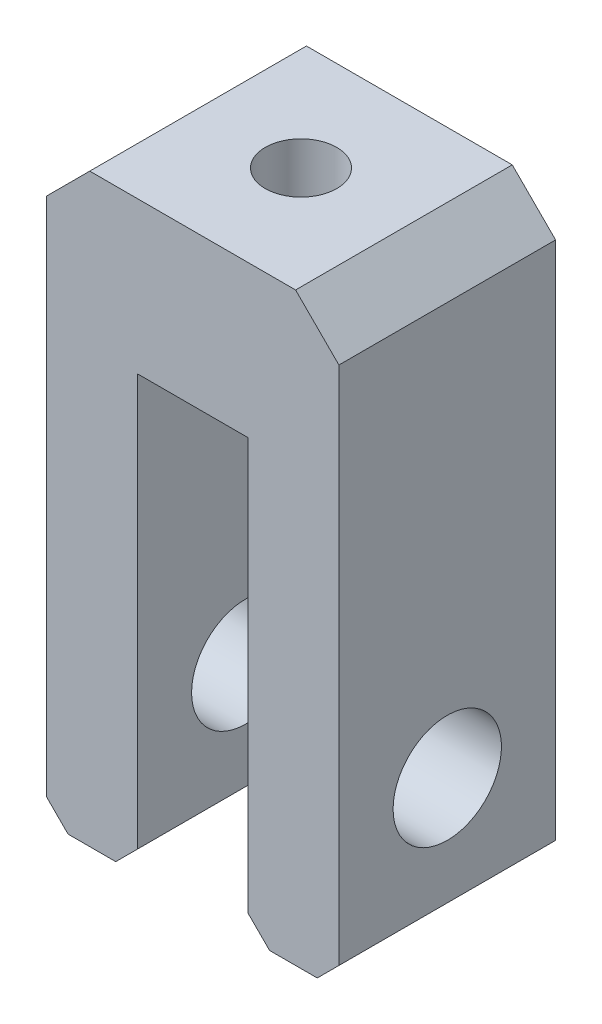
ISO-10303-21;
HEADER;
FILE_DESCRIPTION(('STEP AP214'),'2;1');
FILE_NAME('part.step','',(''),(''),'','','');
FILE_SCHEMA(('AUTOMOTIVE_DESIGN { 1 0 10303 214 1 1 1 1 }'));
ENDSEC;
DATA;
#1=APPLICATION_CONTEXT('core data for automotive mechanical design processes');
#2=APPLICATION_PROTOCOL_DEFINITION('international standard','automotive_design',2000,#1);
#3=PRODUCT_CONTEXT('',#1,'mechanical');
#4=PRODUCT('Part','Part','',(#3));
#5=PRODUCT_RELATED_PRODUCT_CATEGORY('part','',(#4));
#6=PRODUCT_DEFINITION_FORMATION('','',#4);
#7=PRODUCT_DEFINITION_CONTEXT('part definition',#1,'design');
#8=PRODUCT_DEFINITION('design','',#6,#7);
#9=PRODUCT_DEFINITION_SHAPE('','',#8);
#10=(LENGTH_UNIT() NAMED_UNIT(*) SI_UNIT(.MILLI.,.METRE.));
#11=(NAMED_UNIT(*) PLANE_ANGLE_UNIT() SI_UNIT($,.RADIAN.));
#12=(NAMED_UNIT(*) SI_UNIT($,.STERADIAN.) SOLID_ANGLE_UNIT());
#13=UNCERTAINTY_MEASURE_WITH_UNIT(LENGTH_MEASURE(1.E-05),#10,'distance_accuracy_value','');
#14=(GEOMETRIC_REPRESENTATION_CONTEXT(3) GLOBAL_UNCERTAINTY_ASSIGNED_CONTEXT((#13)) GLOBAL_UNIT_ASSIGNED_CONTEXT((#10,
#11,#12)) REPRESENTATION_CONTEXT('',''));
#15=CARTESIAN_POINT('',(0.,0.,0.));
#16=DIRECTION('',(0.,0.,1.));
#17=DIRECTION('',(1.,0.,0.));
#18=AXIS2_PLACEMENT_3D('',#15,#16,#17);
#19=CARTESIAN_POINT('',(-6.75,0.,10.));
#20=DIRECTION('',(1.,0.,0.));
#21=DIRECTION('',(0.,0.,-1.));
#22=AXIS2_PLACEMENT_3D('',#19,#20,#21);
#23=PLANE('',#22);
#24=CARTESIAN_POINT('',(-6.75,6.,5.));
#25=DIRECTION('',(-1.,0.,0.));
#26=DIRECTION('',(0.,0.,1.));
#27=AXIS2_PLACEMENT_3D('',#24,#25,#26);
#28=CIRCLE('',#27,2.5);
#29=CARTESIAN_POINT('',(-6.75,6.,7.5));
#30=VERTEX_POINT('',#29);
#31=EDGE_CURVE('E385',#30,#30,#28,.T.);
#32=ORIENTED_EDGE('',*,*,#31,.F.);
#33=EDGE_LOOP('',(#32));
#34=FACE_BOUND('',#33,.T.);
#35=DIRECTION('',(0.,-1.,0.));
#36=VECTOR('',#35,1.);
#37=CARTESIAN_POINT('',(-6.75,0.,10.));
#38=LINE('',#37,#36);
#39=CARTESIAN_POINT('',(-6.75,25.,10.));
#40=VERTEX_POINT('',#39);
#41=CARTESIAN_POINT('',(-6.75,1.,10.));
#42=VERTEX_POINT('',#41);
#43=EDGE_CURVE('E218',#40,#42,#38,.T.);
#44=ORIENTED_EDGE('',*,*,#43,.F.);
#45=DIRECTION('',(0.,0.,-1.));
#46=VECTOR('',#45,1.);
#47=CARTESIAN_POINT('',(-6.75,25.,10.));
#48=LINE('',#47,#46);
#49=CARTESIAN_POINT('',(-6.75,25.,0.));
#50=VERTEX_POINT('',#49);
#51=EDGE_CURVE('E11',#40,#50,#48,.T.);
#52=ORIENTED_EDGE('',*,*,#51,.T.);
#53=DIRECTION('',(0.,-1.,0.));
#54=VECTOR('',#53,1.);
#55=CARTESIAN_POINT('',(-6.75,0.,0.));
#56=LINE('',#55,#54);
#57=CARTESIAN_POINT('',(-6.75,1.,0.));
#58=VERTEX_POINT('',#57);
#59=EDGE_CURVE('E191',#50,#58,#56,.T.);
#60=ORIENTED_EDGE('',*,*,#59,.T.);
#61=DIRECTION('',(0.,0.,1.));
#62=VECTOR('',#61,1.);
#63=CARTESIAN_POINT('',(-6.75,1.,10.));
#64=LINE('',#63,#62);
#65=EDGE_CURVE('E268',#58,#42,#64,.T.);
#66=ORIENTED_EDGE('',*,*,#65,.T.);
#67=EDGE_LOOP('',(#44,#52,#60,#66));
#68=FACE_BOUND('',#67,.T.);
#69=ADVANCED_FACE('F40',(#34,#68),#23,.F.);
#70=CARTESIAN_POINT('',(-6.75,0.,10.));
#71=DIRECTION('',(0.,1.,0.));
#72=DIRECTION('',(0.,0.,1.));
#73=AXIS2_PLACEMENT_3D('',#70,#71,#72);
#74=PLANE('',#73);
#75=DIRECTION('',(1.,0.,0.));
#76=VECTOR('',#75,1.);
#77=CARTESIAN_POINT('',(-6.75,0.,0.));
#78=LINE('',#77,#76);
#79=CARTESIAN_POINT('',(-5.75,0.,0.));
#80=VERTEX_POINT('',#79);
#81=CARTESIAN_POINT('',(-3.55000000000001,0.,0.));
#82=VERTEX_POINT('',#81);
#83=EDGE_CURVE('E194',#80,#82,#78,.T.);
#84=ORIENTED_EDGE('',*,*,#83,.T.);
#85=DIRECTION('',(0.,0.,1.));
#86=VECTOR('',#85,1.);
#87=CARTESIAN_POINT('',(-3.55000000000001,0.,10.));
#88=LINE('',#87,#86);
#89=CARTESIAN_POINT('',(-3.55000000000001,0.,10.));
#90=VERTEX_POINT('',#89);
#91=EDGE_CURVE('E265',#82,#90,#88,.T.);
#92=ORIENTED_EDGE('',*,*,#91,.T.);
#93=DIRECTION('',(1.,0.,0.));
#94=VECTOR('',#93,1.);
#95=CARTESIAN_POINT('',(-6.75,0.,10.));
#96=LINE('',#95,#94);
#97=CARTESIAN_POINT('',(-5.75,0.,10.));
#98=VERTEX_POINT('',#97);
#99=EDGE_CURVE('E157',#98,#90,#96,.T.);
#100=ORIENTED_EDGE('',*,*,#99,.F.);
#101=DIRECTION('',(0.,0.,-1.));
#102=VECTOR('',#101,1.);
#103=CARTESIAN_POINT('',(-5.75,0.,10.));
#104=LINE('',#103,#102);
#105=EDGE_CURVE('E261',#98,#80,#104,.T.);
#106=ORIENTED_EDGE('',*,*,#105,.T.);
#107=EDGE_LOOP('',(#84,#92,#100,#106));
#108=FACE_BOUND('',#107,.T.);
#109=ADVANCED_FACE('F332',(#108),#74,.F.);
#110=CARTESIAN_POINT('',(-2.55,0.,10.));
#111=DIRECTION('',(-1.,0.,0.));
#112=DIRECTION('',(0.,-1.,0.));
#113=AXIS2_PLACEMENT_3D('',#110,#111,#112);
#114=PLANE('',#113);
#115=CARTESIAN_POINT('',(-2.55,6.,5.));
#116=DIRECTION('',(-1.,0.,0.));
#117=DIRECTION('',(0.,-1.,0.));
#118=AXIS2_PLACEMENT_3D('',#115,#116,#117);
#119=CIRCLE('',#118,2.5);
#120=CARTESIAN_POINT('',(-2.55,3.5,5.));
#121=VERTEX_POINT('',#120);
#122=EDGE_CURVE('E195',#121,#121,#119,.T.);
#123=ORIENTED_EDGE('',*,*,#122,.T.);
#124=EDGE_LOOP('',(#123));
#125=FACE_BOUND('',#124,.T.);
#126=DIRECTION('',(0.,1.,0.));
#127=VECTOR('',#126,1.);
#128=CARTESIAN_POINT('',(-2.55,0.,10.));
#129=LINE('',#128,#127);
#130=CARTESIAN_POINT('',(-2.55,1.,10.));
#131=VERTEX_POINT('',#130);
#132=CARTESIAN_POINT('',(-2.55,20.,10.));
#133=VERTEX_POINT('',#132);
#134=EDGE_CURVE('E143',#131,#133,#129,.T.);
#135=ORIENTED_EDGE('',*,*,#134,.F.);
#136=DIRECTION('',(0.,0.,-1.));
#137=VECTOR('',#136,1.);
#138=CARTESIAN_POINT('',(-2.55,1.,10.));
#139=LINE('',#138,#137);
#140=CARTESIAN_POINT('',(-2.55,1.,0.));
#141=VERTEX_POINT('',#140);
#142=EDGE_CURVE('E258',#131,#141,#139,.T.);
#143=ORIENTED_EDGE('',*,*,#142,.T.);
#144=DIRECTION('',(0.,1.,0.));
#145=VECTOR('',#144,1.);
#146=CARTESIAN_POINT('',(-2.55,0.,0.));
#147=LINE('',#146,#145);
#148=CARTESIAN_POINT('',(-2.55,20.,0.));
#149=VERTEX_POINT('',#148);
#150=EDGE_CURVE('E163',#141,#149,#147,.T.);
#151=ORIENTED_EDGE('',*,*,#150,.T.);
#152=DIRECTION('',(0.,0.,-1.));
#153=VECTOR('',#152,1.);
#154=CARTESIAN_POINT('',(-2.55,20.,10.));
#155=LINE('',#154,#153);
#156=EDGE_CURVE('E160',#133,#149,#155,.T.);
#157=ORIENTED_EDGE('',*,*,#156,.F.);
#158=EDGE_LOOP('',(#135,#143,#151,#157));
#159=FACE_BOUND('',#158,.T.);
#160=ADVANCED_FACE('F161',(#125,#159),#114,.F.);
#161=CARTESIAN_POINT('',(2.55,20.,10.));
#162=DIRECTION('',(0.,1.,0.));
#163=DIRECTION('',(0.,0.,1.));
#164=AXIS2_PLACEMENT_3D('',#161,#162,#163);
#165=PLANE('',#164);
#166=CARTESIAN_POINT('',(0.,20.,5.));
#167=DIRECTION('',(0.,1.,0.));
#168=DIRECTION('',(0.,0.,1.));
#169=AXIS2_PLACEMENT_3D('',#166,#167,#168);
#170=CIRCLE('',#169,1.64999999999999);
#171=CARTESIAN_POINT('',(0.,20.,6.64999999999999));
#172=VERTEX_POINT('',#171);
#173=EDGE_CURVE('E388',#172,#172,#170,.T.);
#174=ORIENTED_EDGE('',*,*,#173,.T.);
#175=EDGE_LOOP('',(#174));
#176=FACE_BOUND('',#175,.T.);
#177=DIRECTION('',(1.,0.,0.));
#178=VECTOR('',#177,1.);
#179=CARTESIAN_POINT('',(2.55,20.,0.));
#180=LINE('',#179,#178);
#181=CARTESIAN_POINT('',(2.55,20.,0.));
#182=VERTEX_POINT('',#181);
#183=EDGE_CURVE('E200',#149,#182,#180,.T.);
#184=ORIENTED_EDGE('',*,*,#183,.T.);
#185=DIRECTION('',(0.,0.,-1.));
#186=VECTOR('',#185,1.);
#187=CARTESIAN_POINT('',(2.55,20.,10.));
#188=LINE('',#187,#186);
#189=CARTESIAN_POINT('',(2.55,20.,10.));
#190=VERTEX_POINT('',#189);
#191=EDGE_CURVE('E168',#190,#182,#188,.T.);
#192=ORIENTED_EDGE('',*,*,#191,.F.);
#193=DIRECTION('',(1.,0.,0.));
#194=VECTOR('',#193,1.);
#195=CARTESIAN_POINT('',(2.55,20.,10.));
#196=LINE('',#195,#194);
#197=EDGE_CURVE('E148',#133,#190,#196,.T.);
#198=ORIENTED_EDGE('',*,*,#197,.F.);
#199=ORIENTED_EDGE('',*,*,#156,.T.);
#200=EDGE_LOOP('',(#184,#192,#198,#199));
#201=FACE_BOUND('',#200,.T.);
#202=ADVANCED_FACE('F170',(#176,#201),#165,.F.);
#203=CARTESIAN_POINT('',(2.55,0.,10.));
#204=DIRECTION('',(1.,0.,0.));
#205=DIRECTION('',(0.,1.,0.));
#206=AXIS2_PLACEMENT_3D('',#203,#204,#205);
#207=PLANE('',#206);
#208=CARTESIAN_POINT('',(2.55,6.,5.));
#209=DIRECTION('',(1.,0.,0.));
#210=DIRECTION('',(0.,1.,0.));
#211=AXIS2_PLACEMENT_3D('',#208,#209,#210);
#212=CIRCLE('',#211,2.5);
#213=CARTESIAN_POINT('',(2.55,8.5,5.));
#214=VERTEX_POINT('',#213);
#215=EDGE_CURVE('E378',#214,#214,#212,.T.);
#216=ORIENTED_EDGE('',*,*,#215,.T.);
#217=EDGE_LOOP('',(#216));
#218=FACE_BOUND('',#217,.T.);
#219=DIRECTION('',(0.,-1.,0.));
#220=VECTOR('',#219,1.);
#221=CARTESIAN_POINT('',(2.55,0.,0.));
#222=LINE('',#221,#220);
#223=CARTESIAN_POINT('',(2.55,1.00000000000001,0.));
#224=VERTEX_POINT('',#223);
#225=EDGE_CURVE('E203',#182,#224,#222,.T.);
#226=ORIENTED_EDGE('',*,*,#225,.T.);
#227=DIRECTION('',(0.,0.,1.));
#228=VECTOR('',#227,1.);
#229=CARTESIAN_POINT('',(2.55,1.00000000000001,10.));
#230=LINE('',#229,#228);
#231=CARTESIAN_POINT('',(2.55,1.00000000000001,10.));
#232=VERTEX_POINT('',#231);
#233=EDGE_CURVE('E255',#224,#232,#230,.T.);
#234=ORIENTED_EDGE('',*,*,#233,.T.);
#235=DIRECTION('',(0.,-1.,0.));
#236=VECTOR('',#235,1.);
#237=CARTESIAN_POINT('',(2.55,0.,10.));
#238=LINE('',#237,#236);
#239=EDGE_CURVE('E174',#190,#232,#238,.T.);
#240=ORIENTED_EDGE('',*,*,#239,.F.);
#241=ORIENTED_EDGE('',*,*,#191,.T.);
#242=EDGE_LOOP('',(#226,#234,#240,#241));
#243=FACE_BOUND('',#242,.T.);
#244=ADVANCED_FACE('F319',(#218,#243),#207,.F.);
#245=CARTESIAN_POINT('',(6.75,0.,10.));
#246=DIRECTION('',(0.,1.,0.));
#247=DIRECTION('',(0.,0.,1.));
#248=AXIS2_PLACEMENT_3D('',#245,#246,#247);
#249=PLANE('',#248);
#250=DIRECTION('',(1.,0.,0.));
#251=VECTOR('',#250,1.);
#252=CARTESIAN_POINT('',(6.75,0.,0.));
#253=LINE('',#252,#251);
#254=CARTESIAN_POINT('',(3.55,0.,0.));
#255=VERTEX_POINT('',#254);
#256=CARTESIAN_POINT('',(5.75,0.,0.));
#257=VERTEX_POINT('',#256);
#258=EDGE_CURVE('E207',#255,#257,#253,.T.);
#259=ORIENTED_EDGE('',*,*,#258,.T.);
#260=DIRECTION('',(0.,0.,1.));
#261=VECTOR('',#260,1.);
#262=CARTESIAN_POINT('',(5.75,0.,10.));
#263=LINE('',#262,#261);
#264=CARTESIAN_POINT('',(5.75,0.,10.));
#265=VERTEX_POINT('',#264);
#266=EDGE_CURVE('E241',#257,#265,#263,.T.);
#267=ORIENTED_EDGE('',*,*,#266,.T.);
#268=DIRECTION('',(1.,0.,0.));
#269=VECTOR('',#268,1.);
#270=CARTESIAN_POINT('',(6.75,0.,10.));
#271=LINE('',#270,#269);
#272=CARTESIAN_POINT('',(3.55,0.,10.));
#273=VERTEX_POINT('',#272);
#274=EDGE_CURVE('E179',#273,#265,#271,.T.);
#275=ORIENTED_EDGE('',*,*,#274,.F.);
#276=DIRECTION('',(0.,0.,-1.));
#277=VECTOR('',#276,1.);
#278=CARTESIAN_POINT('',(3.55,0.,10.));
#279=LINE('',#278,#277);
#280=EDGE_CURVE('E237',#273,#255,#279,.T.);
#281=ORIENTED_EDGE('',*,*,#280,.T.);
#282=EDGE_LOOP('',(#259,#267,#275,#281));
#283=FACE_BOUND('',#282,.T.);
#284=ADVANCED_FACE('F310',(#283),#249,.F.);
#285=CARTESIAN_POINT('',(6.75,0.,10.));
#286=DIRECTION('',(-1.,0.,0.));
#287=DIRECTION('',(0.,0.,1.));
#288=AXIS2_PLACEMENT_3D('',#285,#286,#287);
#289=PLANE('',#288);
#290=CARTESIAN_POINT('',(6.75,6.,5.));
#291=DIRECTION('',(-1.,0.,0.));
#292=DIRECTION('',(0.,0.,1.));
#293=AXIS2_PLACEMENT_3D('',#290,#291,#292);
#294=CIRCLE('',#293,2.5);
#295=CARTESIAN_POINT('',(6.75,6.,7.5));
#296=VERTEX_POINT('',#295);
#297=EDGE_CURVE('E381',#296,#296,#294,.F.);
#298=ORIENTED_EDGE('',*,*,#297,.F.);
#299=EDGE_LOOP('',(#298));
#300=FACE_BOUND('',#299,.T.);
#301=DIRECTION('',(0.,1.,0.));
#302=VECTOR('',#301,1.);
#303=CARTESIAN_POINT('',(6.75,0.,0.));
#304=LINE('',#303,#302);
#305=CARTESIAN_POINT('',(6.75,1.,0.));
#306=VERTEX_POINT('',#305);
#307=CARTESIAN_POINT('',(6.75,25.,0.));
#308=VERTEX_POINT('',#307);
#309=EDGE_CURVE('E211',#306,#308,#304,.T.);
#310=ORIENTED_EDGE('',*,*,#309,.T.);
#311=DIRECTION('',(0.,0.,1.));
#312=VECTOR('',#311,1.);
#313=CARTESIAN_POINT('',(6.75,25.,10.));
#314=LINE('',#313,#312);
#315=CARTESIAN_POINT('',(6.75,25.,10.));
#316=VERTEX_POINT('',#315);
#317=EDGE_CURVE('E64',#308,#316,#314,.T.);
#318=ORIENTED_EDGE('',*,*,#317,.T.);
#319=DIRECTION('',(0.,1.,0.));
#320=VECTOR('',#319,1.);
#321=CARTESIAN_POINT('',(6.75,0.,10.));
#322=LINE('',#321,#320);
#323=CARTESIAN_POINT('',(6.75,1.,10.));
#324=VERTEX_POINT('',#323);
#325=EDGE_CURVE('E186',#324,#316,#322,.T.);
#326=ORIENTED_EDGE('',*,*,#325,.F.);
#327=DIRECTION('',(0.,0.,-1.));
#328=VECTOR('',#327,1.);
#329=CARTESIAN_POINT('',(6.75,1.,10.));
#330=LINE('',#329,#328);
#331=EDGE_CURVE('E167',#324,#306,#330,.T.);
#332=ORIENTED_EDGE('',*,*,#331,.T.);
#333=EDGE_LOOP('',(#310,#318,#326,#332));
#334=FACE_BOUND('',#333,.T.);
#335=ADVANCED_FACE('F302',(#300,#334),#289,.F.);
#336=CARTESIAN_POINT('',(6.75,27.,10.));
#337=DIRECTION('',(0.,-1.,0.));
#338=DIRECTION('',(0.,0.,-1.));
#339=AXIS2_PLACEMENT_3D('',#336,#337,#338);
#340=PLANE('',#339);
#341=CARTESIAN_POINT('',(0.,27.,5.));
#342=DIRECTION('',(0.,1.,0.));
#343=DIRECTION('',(0.,0.,1.));
#344=AXIS2_PLACEMENT_3D('',#341,#342,#343);
#345=CIRCLE('',#344,1.64999999999999);
#346=CARTESIAN_POINT('',(0.,27.,6.64999999999999));
#347=VERTEX_POINT('',#346);
#348=EDGE_CURVE('E392',#347,#347,#345,.T.);
#349=ORIENTED_EDGE('',*,*,#348,.F.);
#350=EDGE_LOOP('',(#349));
#351=FACE_BOUND('',#350,.T.);
#352=DIRECTION('',(-1.,0.,0.));
#353=VECTOR('',#352,1.);
#354=CARTESIAN_POINT('',(6.75,27.,10.));
#355=LINE('',#354,#353);
#356=CARTESIAN_POINT('',(4.75,27.,10.));
#357=VERTEX_POINT('',#356);
#358=CARTESIAN_POINT('',(-4.74999999999999,27.,10.));
#359=VERTEX_POINT('',#358);
#360=EDGE_CURVE('E188',#357,#359,#355,.T.);
#361=ORIENTED_EDGE('',*,*,#360,.F.);
#362=DIRECTION('',(0.,0.,-1.));
#363=VECTOR('',#362,1.);
#364=CARTESIAN_POINT('',(4.75,27.,10.));
#365=LINE('',#364,#363);
#366=CARTESIAN_POINT('',(4.75,27.,0.));
#367=VERTEX_POINT('',#366);
#368=EDGE_CURVE('E275',#357,#367,#365,.T.);
#369=ORIENTED_EDGE('',*,*,#368,.T.);
#370=DIRECTION('',(-1.,0.,0.));
#371=VECTOR('',#370,1.);
#372=CARTESIAN_POINT('',(6.75,27.,0.));
#373=LINE('',#372,#371);
#374=CARTESIAN_POINT('',(-4.75,27.,0.));
#375=VERTEX_POINT('',#374);
#376=EDGE_CURVE('E214',#367,#375,#373,.T.);
#377=ORIENTED_EDGE('',*,*,#376,.T.);
#378=DIRECTION('',(0.,0.,1.));
#379=VECTOR('',#378,1.);
#380=CARTESIAN_POINT('',(-4.75,27.,10.));
#381=LINE('',#380,#379);
#382=EDGE_CURVE('E272',#375,#359,#381,.T.);
#383=ORIENTED_EDGE('',*,*,#382,.T.);
#384=EDGE_LOOP('',(#361,#369,#377,#383));
#385=FACE_BOUND('',#384,.T.);
#386=ADVANCED_FACE('F295',(#351,#385),#340,.F.);
#387=CARTESIAN_POINT('',(0.,0.,10.));
#388=DIRECTION('',(0.,0.,1.));
#389=DIRECTION('',(1.,0.,0.));
#390=AXIS2_PLACEMENT_3D('',#387,#388,#389);
#391=PLANE('',#390);
#392=ORIENTED_EDGE('',*,*,#325,.T.);
#393=DIRECTION('',(0.707106781186546,-0.707106781186549,0.));
#394=VECTOR('',#393,1.);
#395=CARTESIAN_POINT('',(15.875,15.8749999999999,10.));
#396=LINE('',#395,#394);
#397=EDGE_CURVE('E49',#316,#357,#396,.F.);
#398=ORIENTED_EDGE('',*,*,#397,.T.);
#399=ORIENTED_EDGE('',*,*,#360,.T.);
#400=DIRECTION('',(0.707106781186549,0.707106781186546,0.));
#401=VECTOR('',#400,1.);
#402=CARTESIAN_POINT('',(-15.875,15.875,10.));
#403=LINE('',#402,#401);
#404=EDGE_CURVE('E56',#359,#40,#403,.F.);
#405=ORIENTED_EDGE('',*,*,#404,.T.);
#406=ORIENTED_EDGE('',*,*,#43,.T.);
#407=DIRECTION('',(-0.707106781186546,0.707106781186549,0.));
#408=VECTOR('',#407,1.);
#409=CARTESIAN_POINT('',(-2.87500000000001,-2.875,10.));
#410=LINE('',#409,#408);
#411=EDGE_CURVE('E244',#42,#98,#410,.F.);
#412=ORIENTED_EDGE('',*,*,#411,.T.);
#413=ORIENTED_EDGE('',*,*,#99,.T.);
#414=DIRECTION('',(-0.70710678118655,-0.707106781186545,0.));
#415=VECTOR('',#414,1.);
#416=CARTESIAN_POINT('',(-1.77499999999999,1.77500000000001,10.));
#417=LINE('',#416,#415);
#418=EDGE_CURVE('E152',#90,#131,#417,.F.);
#419=ORIENTED_EDGE('',*,*,#418,.T.);
#420=ORIENTED_EDGE('',*,*,#134,.T.);
#421=ORIENTED_EDGE('',*,*,#197,.T.);
#422=ORIENTED_EDGE('',*,*,#239,.T.);
#423=DIRECTION('',(-0.707106781186545,0.70710678118655,0.));
#424=VECTOR('',#423,1.);
#425=CARTESIAN_POINT('',(1.77500000000001,1.775,10.));
#426=LINE('',#425,#424);
#427=EDGE_CURVE('E249',#232,#273,#426,.F.);
#428=ORIENTED_EDGE('',*,*,#427,.T.);
#429=ORIENTED_EDGE('',*,*,#274,.T.);
#430=DIRECTION('',(-0.707106781186549,-0.707106781186546,0.));
#431=VECTOR('',#430,1.);
#432=CARTESIAN_POINT('',(2.87499999999999,-2.875,10.));
#433=LINE('',#432,#431);
#434=EDGE_CURVE('E252',#265,#324,#433,.F.);
#435=ORIENTED_EDGE('',*,*,#434,.T.);
#436=EDGE_LOOP('',(#392,#398,#399,#405,#406,#412,#413,#419,#420,#421,#422,#428,#429,#435));
#437=FACE_BOUND('',#436,.T.);
#438=ADVANCED_FACE('F145',(#437),#391,.T.);
#439=CARTESIAN_POINT('',(0.,0.,0.));
#440=DIRECTION('',(0.,0.,1.));
#441=DIRECTION('',(1.,0.,0.));
#442=AXIS2_PLACEMENT_3D('',#439,#440,#441);
#443=PLANE('',#442);
#444=ORIENTED_EDGE('',*,*,#376,.F.);
#445=DIRECTION('',(-0.707106781186546,0.707106781186549,0.));
#446=VECTOR('',#445,1.);
#447=CARTESIAN_POINT('',(4.75,27.,0.));
#448=LINE('',#447,#446);
#449=EDGE_CURVE('E282',#367,#308,#448,.F.);
#450=ORIENTED_EDGE('',*,*,#449,.T.);
#451=ORIENTED_EDGE('',*,*,#309,.F.);
#452=DIRECTION('',(0.707106781186549,0.707106781186546,0.));
#453=VECTOR('',#452,1.);
#454=CARTESIAN_POINT('',(6.75,1.,0.));
#455=LINE('',#454,#453);
#456=EDGE_CURVE('E234',#306,#257,#455,.F.);
#457=ORIENTED_EDGE('',*,*,#456,.T.);
#458=ORIENTED_EDGE('',*,*,#258,.F.);
#459=DIRECTION('',(0.707106781186545,-0.70710678118655,0.));
#460=VECTOR('',#459,1.);
#461=CARTESIAN_POINT('',(3.55,0.,0.));
#462=LINE('',#461,#460);
#463=EDGE_CURVE('E231',#255,#224,#462,.F.);
#464=ORIENTED_EDGE('',*,*,#463,.T.);
#465=ORIENTED_EDGE('',*,*,#225,.F.);
#466=ORIENTED_EDGE('',*,*,#183,.F.);
#467=ORIENTED_EDGE('',*,*,#150,.F.);
#468=DIRECTION('',(0.70710678118655,0.707106781186545,0.));
#469=VECTOR('',#468,1.);
#470=CARTESIAN_POINT('',(-2.55,1.,0.));
#471=LINE('',#470,#469);
#472=EDGE_CURVE('E228',#141,#82,#471,.F.);
#473=ORIENTED_EDGE('',*,*,#472,.T.);
#474=ORIENTED_EDGE('',*,*,#83,.F.);
#475=DIRECTION('',(0.707106781186546,-0.707106781186549,0.));
#476=VECTOR('',#475,1.);
#477=CARTESIAN_POINT('',(-5.75,0.,0.));
#478=LINE('',#477,#476);
#479=EDGE_CURVE('E224',#80,#58,#478,.F.);
#480=ORIENTED_EDGE('',*,*,#479,.T.);
#481=ORIENTED_EDGE('',*,*,#59,.F.);
#482=DIRECTION('',(-0.707106781186549,-0.707106781186546,0.));
#483=VECTOR('',#482,1.);
#484=CARTESIAN_POINT('',(-6.75,25.,0.));
#485=LINE('',#484,#483);
#486=EDGE_CURVE('E279',#50,#375,#485,.F.);
#487=ORIENTED_EDGE('',*,*,#486,.T.);
#488=EDGE_LOOP('',(#444,#450,#451,#457,#458,#464,#465,#466,#467,#473,#474,#480,#481,#487));
#489=FACE_BOUND('',#488,.T.);
#490=ADVANCED_FACE('F301',(#489),#443,.F.);
#491=CARTESIAN_POINT('',(13.8210678118655,6.,5.));
#492=DIRECTION('',(-1.,0.,0.));
#493=DIRECTION('',(0.,0.,1.));
#494=AXIS2_PLACEMENT_3D('',#491,#492,#493);
#495=CYLINDRICAL_SURFACE('',#494,2.5);
#496=ORIENTED_EDGE('',*,*,#297,.T.);
#497=EDGE_LOOP('',(#496));
#498=FACE_BOUND('',#497,.T.);
#499=ORIENTED_EDGE('',*,*,#215,.F.);
#500=EDGE_LOOP('',(#499));
#501=FACE_BOUND('',#500,.T.);
#502=ADVANCED_FACE('F410',(#498,#501),#495,.F.);
#503=ORIENTED_EDGE('',*,*,#31,.T.);
#504=EDGE_LOOP('',(#503));
#505=FACE_BOUND('',#504,.T.);
#506=ORIENTED_EDGE('',*,*,#122,.F.);
#507=EDGE_LOOP('',(#506));
#508=FACE_BOUND('',#507,.T.);
#509=ADVANCED_FACE('F412',(#505,#508),#495,.F.);
#510=CARTESIAN_POINT('',(0.,27.,5.));
#511=DIRECTION('',(0.,1.,0.));
#512=DIRECTION('',(0.,0.,1.));
#513=AXIS2_PLACEMENT_3D('',#510,#511,#512);
#514=CYLINDRICAL_SURFACE('',#513,1.64999999999999);
#515=ORIENTED_EDGE('',*,*,#348,.T.);
#516=EDGE_LOOP('',(#515));
#517=FACE_BOUND('',#516,.T.);
#518=ORIENTED_EDGE('',*,*,#173,.F.);
#519=EDGE_LOOP('',(#518));
#520=FACE_BOUND('',#519,.T.);
#521=ADVANCED_FACE('F346',(#517,#520),#514,.F.);
#522=CARTESIAN_POINT('',(6.75,1.,10.));
#523=DIRECTION('',(-0.707106781186546,0.707106781186549,0.));
#524=DIRECTION('',(0.,0.,-1.));
#525=AXIS2_PLACEMENT_3D('',#522,#523,#524);
#526=PLANE('',#525);
#527=ORIENTED_EDGE('',*,*,#434,.F.);
#528=ORIENTED_EDGE('',*,*,#266,.F.);
#529=ORIENTED_EDGE('',*,*,#456,.F.);
#530=ORIENTED_EDGE('',*,*,#331,.F.);
#531=EDGE_LOOP('',(#527,#528,#529,#530));
#532=FACE_BOUND('',#531,.T.);
#533=ADVANCED_FACE('F306',(#532),#526,.F.);
#534=CARTESIAN_POINT('',(3.55,0.,10.));
#535=DIRECTION('',(0.70710678118655,0.707106781186545,0.));
#536=DIRECTION('',(0.,0.,-1.));
#537=AXIS2_PLACEMENT_3D('',#534,#535,#536);
#538=PLANE('',#537);
#539=ORIENTED_EDGE('',*,*,#427,.F.);
#540=ORIENTED_EDGE('',*,*,#233,.F.);
#541=ORIENTED_EDGE('',*,*,#463,.F.);
#542=ORIENTED_EDGE('',*,*,#280,.F.);
#543=EDGE_LOOP('',(#539,#540,#541,#542));
#544=FACE_BOUND('',#543,.T.);
#545=ADVANCED_FACE('F315',(#544),#538,.F.);
#546=CARTESIAN_POINT('',(-2.55,1.,10.));
#547=DIRECTION('',(-0.707106781186545,0.70710678118655,0.));
#548=DIRECTION('',(0.,0.,-1.));
#549=AXIS2_PLACEMENT_3D('',#546,#547,#548);
#550=PLANE('',#549);
#551=ORIENTED_EDGE('',*,*,#418,.F.);
#552=ORIENTED_EDGE('',*,*,#91,.F.);
#553=ORIENTED_EDGE('',*,*,#472,.F.);
#554=ORIENTED_EDGE('',*,*,#142,.F.);
#555=EDGE_LOOP('',(#551,#552,#553,#554));
#556=FACE_BOUND('',#555,.T.);
#557=ADVANCED_FACE('F349',(#556),#550,.F.);
#558=CARTESIAN_POINT('',(-5.75,0.,10.));
#559=DIRECTION('',(0.707106781186549,0.707106781186546,0.));
#560=DIRECTION('',(0.,0.,-1.));
#561=AXIS2_PLACEMENT_3D('',#558,#559,#560);
#562=PLANE('',#561);
#563=ORIENTED_EDGE('',*,*,#411,.F.);
#564=ORIENTED_EDGE('',*,*,#65,.F.);
#565=ORIENTED_EDGE('',*,*,#479,.F.);
#566=ORIENTED_EDGE('',*,*,#105,.F.);
#567=EDGE_LOOP('',(#563,#564,#565,#566));
#568=FACE_BOUND('',#567,.T.);
#569=ADVANCED_FACE('F352',(#568),#562,.F.);
#570=CARTESIAN_POINT('',(4.75,27.,10.));
#571=DIRECTION('',(-0.707106781186549,-0.707106781186546,0.));
#572=DIRECTION('',(0.,0.,-1.));
#573=AXIS2_PLACEMENT_3D('',#570,#571,#572);
#574=PLANE('',#573);
#575=ORIENTED_EDGE('',*,*,#397,.F.);
#576=ORIENTED_EDGE('',*,*,#317,.F.);
#577=ORIENTED_EDGE('',*,*,#449,.F.);
#578=ORIENTED_EDGE('',*,*,#368,.F.);
#579=EDGE_LOOP('',(#575,#576,#577,#578));
#580=FACE_BOUND('',#579,.T.);
#581=ADVANCED_FACE('F298',(#580),#574,.F.);
#582=CARTESIAN_POINT('',(-6.75,25.,10.));
#583=DIRECTION('',(0.707106781186546,-0.707106781186549,0.));
#584=DIRECTION('',(0.,0.,-1.));
#585=AXIS2_PLACEMENT_3D('',#582,#583,#584);
#586=PLANE('',#585);
#587=ORIENTED_EDGE('',*,*,#404,.F.);
#588=ORIENTED_EDGE('',*,*,#382,.F.);
#589=ORIENTED_EDGE('',*,*,#486,.F.);
#590=ORIENTED_EDGE('',*,*,#51,.F.);
#591=EDGE_LOOP('',(#587,#588,#589,#590));
#592=FACE_BOUND('',#591,.T.);
#593=ADVANCED_FACE('F42',(#592),#586,.F.);
#594=CLOSED_SHELL('',(#69,#109,#160,#202,#244,#284,#335,#386,#438,#490,#502,#509,#521,#533,#545,
#557,#569,#581,#593));
#595=MANIFOLD_SOLID_BREP('B2',#594);
#596=ADVANCED_BREP_SHAPE_REPRESENTATION('',(#18,#595),#14);
#597=SHAPE_DEFINITION_REPRESENTATION(#9,#596);
ENDSEC;
END-ISO-10303-21;
